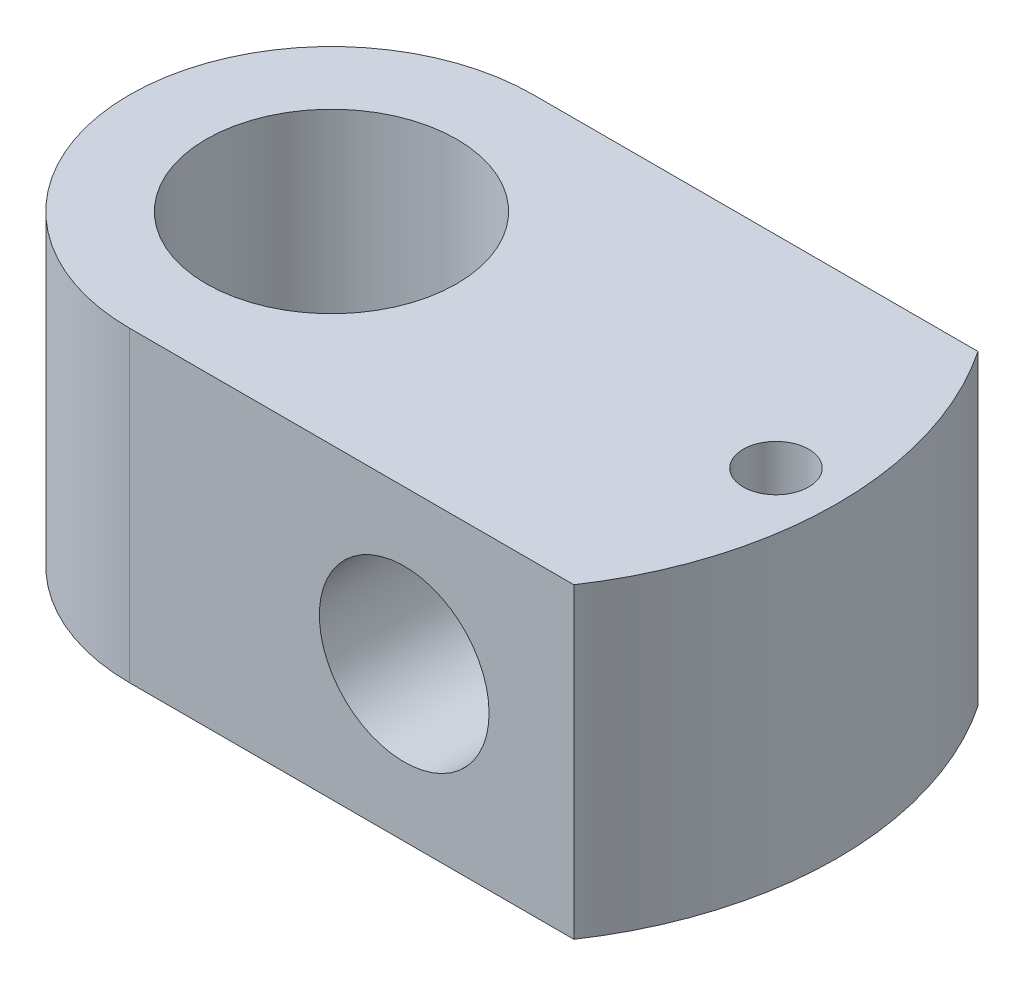
ISO-10303-21;
HEADER;
FILE_DESCRIPTION(('STEP AP214'),'2;1');
FILE_NAME('part.step','',(''),(''),'','','');
FILE_SCHEMA(('AUTOMOTIVE_DESIGN { 1 0 10303 214 1 1 1 1 }'));
ENDSEC;
DATA;
#1=APPLICATION_CONTEXT('core data for automotive mechanical design processes');
#2=APPLICATION_PROTOCOL_DEFINITION('international standard','automotive_design',2000,#1);
#3=PRODUCT_CONTEXT('',#1,'mechanical');
#4=PRODUCT('Part','Part','',(#3));
#5=PRODUCT_RELATED_PRODUCT_CATEGORY('part','',(#4));
#6=PRODUCT_DEFINITION_FORMATION('','',#4);
#7=PRODUCT_DEFINITION_CONTEXT('part definition',#1,'design');
#8=PRODUCT_DEFINITION('design','',#6,#7);
#9=PRODUCT_DEFINITION_SHAPE('','',#8);
#10=(LENGTH_UNIT() NAMED_UNIT(*) SI_UNIT(.MILLI.,.METRE.));
#11=(NAMED_UNIT(*) PLANE_ANGLE_UNIT() SI_UNIT($,.RADIAN.));
#12=(NAMED_UNIT(*) SI_UNIT($,.STERADIAN.) SOLID_ANGLE_UNIT());
#13=UNCERTAINTY_MEASURE_WITH_UNIT(LENGTH_MEASURE(1.E-05),#10,'distance_accuracy_value','');
#14=(GEOMETRIC_REPRESENTATION_CONTEXT(3) GLOBAL_UNCERTAINTY_ASSIGNED_CONTEXT((#13)) GLOBAL_UNIT_ASSIGNED_CONTEXT((#10,
#11,#12)) REPRESENTATION_CONTEXT('',''));
#15=CARTESIAN_POINT('',(0.,0.,0.));
#16=DIRECTION('',(0.,0.,1.));
#17=DIRECTION('',(1.,0.,0.));
#18=AXIS2_PLACEMENT_3D('',#15,#16,#17);
#19=CARTESIAN_POINT('',(0.,24.13,0.));
#20=DIRECTION('',(0.,-1.,0.));
#21=DIRECTION('',(0.,0.,-1.));
#22=AXIS2_PLACEMENT_3D('',#19,#20,#21);
#23=CYLINDRICAL_SURFACE('',#22,31.75);
#24=CARTESIAN_POINT('',(0.,-24.13,0.));
#25=DIRECTION('',(0.,1.,0.));
#26=DIRECTION('',(0.,0.,1.));
#27=AXIS2_PLACEMENT_3D('',#24,#25,#26);
#28=CIRCLE('',#27,31.75);
#29=CARTESIAN_POINT('',(0.,-24.13,-31.75));
#30=VERTEX_POINT('',#29);
#31=CARTESIAN_POINT('',(0.,-24.13,31.75));
#32=VERTEX_POINT('',#31);
#33=EDGE_CURVE('E95',#30,#32,#28,.T.);
#34=ORIENTED_EDGE('',*,*,#33,.T.);
#35=DIRECTION('',(0.,-1.,0.));
#36=VECTOR('',#35,1.);
#37=CARTESIAN_POINT('',(0.,24.13,31.75));
#38=LINE('',#37,#36);
#39=CARTESIAN_POINT('',(0.,24.13,31.75));
#40=VERTEX_POINT('',#39);
#41=EDGE_CURVE('E11',#40,#32,#38,.T.);
#42=ORIENTED_EDGE('',*,*,#41,.F.);
#43=CARTESIAN_POINT('',(0.,24.13,0.));
#44=DIRECTION('',(0.,1.,0.));
#45=DIRECTION('',(0.,0.,1.));
#46=AXIS2_PLACEMENT_3D('',#43,#44,#45);
#47=CIRCLE('',#46,31.75);
#48=CARTESIAN_POINT('',(0.,24.13,-31.75));
#49=VERTEX_POINT('',#48);
#50=EDGE_CURVE('E83',#49,#40,#47,.T.);
#51=ORIENTED_EDGE('',*,*,#50,.F.);
#52=DIRECTION('',(0.,-1.,0.));
#53=VECTOR('',#52,1.);
#54=CARTESIAN_POINT('',(0.,24.13,-31.75));
#55=LINE('',#54,#53);
#56=EDGE_CURVE('E91',#49,#30,#55,.T.);
#57=ORIENTED_EDGE('',*,*,#56,.T.);
#58=EDGE_LOOP('',(#34,#42,#51,#57));
#59=FACE_BOUND('',#58,.T.);
#60=ADVANCED_FACE('F32',(#59),#23,.T.);
#61=CARTESIAN_POINT('',(0.,24.13,31.75));
#62=DIRECTION('',(0.,0.,-1.));
#63=DIRECTION('',(-1.,0.,0.));
#64=AXIS2_PLACEMENT_3D('',#61,#62,#63);
#65=PLANE('',#64);
#66=CARTESIAN_POINT('',(43.18,0.,31.75));
#67=DIRECTION('',(0.,0.,1.));
#68=DIRECTION('',(1.,0.,0.));
#69=AXIS2_PLACEMENT_3D('',#66,#67,#68);
#70=CIRCLE('',#69,13.335);
#71=CARTESIAN_POINT('',(56.515,0.,31.75));
#72=VERTEX_POINT('',#71);
#73=EDGE_CURVE('E115',#72,#72,#70,.T.);
#74=ORIENTED_EDGE('',*,*,#73,.F.);
#75=EDGE_LOOP('',(#74));
#76=FACE_BOUND('',#75,.T.);
#77=DIRECTION('',(1.,0.,0.));
#78=VECTOR('',#77,1.);
#79=CARTESIAN_POINT('',(0.,-24.13,31.75));
#80=LINE('',#79,#78);
#81=CARTESIAN_POINT('',(69.85,-24.13,31.75));
#82=VERTEX_POINT('',#81);
#83=EDGE_CURVE('E87',#32,#82,#80,.T.);
#84=ORIENTED_EDGE('',*,*,#83,.T.);
#85=DIRECTION('',(0.,-1.,0.));
#86=VECTOR('',#85,1.);
#87=CARTESIAN_POINT('',(69.85,24.13,31.75));
#88=LINE('',#87,#86);
#89=CARTESIAN_POINT('',(69.85,24.13,31.75));
#90=VERTEX_POINT('',#89);
#91=EDGE_CURVE('E40',#90,#82,#88,.T.);
#92=ORIENTED_EDGE('',*,*,#91,.F.);
#93=DIRECTION('',(1.,0.,0.));
#94=VECTOR('',#93,1.);
#95=CARTESIAN_POINT('',(0.,24.13,31.75));
#96=LINE('',#95,#94);
#97=EDGE_CURVE('E78',#40,#90,#96,.T.);
#98=ORIENTED_EDGE('',*,*,#97,.F.);
#99=ORIENTED_EDGE('',*,*,#41,.T.);
#100=EDGE_LOOP('',(#84,#92,#98,#99));
#101=FACE_BOUND('',#100,.T.);
#102=ADVANCED_FACE('F86',(#76,#101),#65,.F.);
#103=CARTESIAN_POINT('',(22.4556052631578,24.13,0.));
#104=DIRECTION('',(0.,-1.,0.));
#105=DIRECTION('',(0.,0.,-1.));
#106=AXIS2_PLACEMENT_3D('',#103,#104,#105);
#107=CYLINDRICAL_SURFACE('',#106,57.0463947368421);
#108=CARTESIAN_POINT('',(22.4556052631578,-24.13,0.));
#109=DIRECTION('',(0.,1.,0.));
#110=DIRECTION('',(0.,0.,-1.));
#111=AXIS2_PLACEMENT_3D('',#108,#109,#110);
#112=CIRCLE('',#111,57.0463947368421);
#113=CARTESIAN_POINT('',(69.85,-24.13,-31.75));
#114=VERTEX_POINT('',#113);
#115=EDGE_CURVE('E65',#82,#114,#112,.T.);
#116=ORIENTED_EDGE('',*,*,#115,.T.);
#117=DIRECTION('',(0.,-1.,0.));
#118=VECTOR('',#117,1.);
#119=CARTESIAN_POINT('',(69.85,24.13,-31.75));
#120=LINE('',#119,#118);
#121=CARTESIAN_POINT('',(69.85,24.13,-31.75));
#122=VERTEX_POINT('',#121);
#123=EDGE_CURVE('E88',#122,#114,#120,.T.);
#124=ORIENTED_EDGE('',*,*,#123,.F.);
#125=CARTESIAN_POINT('',(22.4556052631578,24.13,0.));
#126=DIRECTION('',(0.,1.,0.));
#127=DIRECTION('',(0.,0.,-1.));
#128=AXIS2_PLACEMENT_3D('',#125,#126,#127);
#129=CIRCLE('',#128,57.0463947368421);
#130=EDGE_CURVE('E81',#90,#122,#129,.T.);
#131=ORIENTED_EDGE('',*,*,#130,.F.);
#132=ORIENTED_EDGE('',*,*,#91,.T.);
#133=EDGE_LOOP('',(#116,#124,#131,#132));
#134=FACE_BOUND('',#133,.T.);
#135=ADVANCED_FACE('F89',(#134),#107,.T.);
#136=CARTESIAN_POINT('',(0.,24.13,-31.75));
#137=DIRECTION('',(0.,0.,1.));
#138=DIRECTION('',(1.,0.,0.));
#139=AXIS2_PLACEMENT_3D('',#136,#137,#138);
#140=PLANE('',#139);
#141=CARTESIAN_POINT('',(43.18,0.,-31.75));
#142=DIRECTION('',(0.,0.,1.));
#143=DIRECTION('',(1.,0.,0.));
#144=AXIS2_PLACEMENT_3D('',#141,#142,#143);
#145=CIRCLE('',#144,13.335);
#146=CARTESIAN_POINT('',(56.515,0.,-31.75));
#147=VERTEX_POINT('',#146);
#148=EDGE_CURVE('E112',#147,#147,#145,.T.);
#149=ORIENTED_EDGE('',*,*,#148,.T.);
#150=EDGE_LOOP('',(#149));
#151=FACE_BOUND('',#150,.T.);
#152=DIRECTION('',(-1.,0.,0.));
#153=VECTOR('',#152,1.);
#154=CARTESIAN_POINT('',(0.,-24.13,-31.75));
#155=LINE('',#154,#153);
#156=EDGE_CURVE('E71',#114,#30,#155,.T.);
#157=ORIENTED_EDGE('',*,*,#156,.T.);
#158=ORIENTED_EDGE('',*,*,#56,.F.);
#159=DIRECTION('',(-1.,0.,0.));
#160=VECTOR('',#159,1.);
#161=CARTESIAN_POINT('',(0.,24.13,-31.75));
#162=LINE('',#161,#160);
#163=EDGE_CURVE('E48',#122,#49,#162,.T.);
#164=ORIENTED_EDGE('',*,*,#163,.F.);
#165=ORIENTED_EDGE('',*,*,#123,.T.);
#166=EDGE_LOOP('',(#157,#158,#164,#165));
#167=FACE_BOUND('',#166,.T.);
#168=ADVANCED_FACE('F103',(#151,#167),#140,.F.);
#169=CARTESIAN_POINT('',(0.,24.13,0.));
#170=DIRECTION('',(0.,1.,0.));
#171=DIRECTION('',(0.,0.,1.));
#172=AXIS2_PLACEMENT_3D('',#169,#170,#171);
#173=PLANE('',#172);
#174=CARTESIAN_POINT('',(69.85,24.13,0.));
#175=DIRECTION('',(0.,1.,0.));
#176=DIRECTION('',(0.,0.,1.));
#177=AXIS2_PLACEMENT_3D('',#174,#175,#176);
#178=CIRCLE('',#177,5.1435);
#179=CARTESIAN_POINT('',(69.85,24.13,5.1435));
#180=VERTEX_POINT('',#179);
#181=EDGE_CURVE('E121',#180,#180,#178,.T.);
#182=ORIENTED_EDGE('',*,*,#181,.F.);
#183=EDGE_LOOP('',(#182));
#184=FACE_BOUND('',#183,.T.);
#185=CARTESIAN_POINT('',(0.,24.13,0.));
#186=DIRECTION('',(0.,1.,0.));
#187=DIRECTION('',(0.,0.,1.));
#188=AXIS2_PLACEMENT_3D('',#185,#186,#187);
#189=CIRCLE('',#188,19.685);
#190=CARTESIAN_POINT('',(0.,24.13,19.685));
#191=VERTEX_POINT('',#190);
#192=EDGE_CURVE('E109',#191,#191,#189,.T.);
#193=ORIENTED_EDGE('',*,*,#192,.F.);
#194=EDGE_LOOP('',(#193));
#195=FACE_BOUND('',#194,.T.);
#196=ORIENTED_EDGE('',*,*,#50,.T.);
#197=ORIENTED_EDGE('',*,*,#97,.T.);
#198=ORIENTED_EDGE('',*,*,#130,.T.);
#199=ORIENTED_EDGE('',*,*,#163,.T.);
#200=EDGE_LOOP('',(#196,#197,#198,#199));
#201=FACE_BOUND('',#200,.T.);
#202=ADVANCED_FACE('F79',(#184,#195,#201),#173,.T.);
#203=CARTESIAN_POINT('',(0.,-24.13,0.));
#204=DIRECTION('',(0.,1.,0.));
#205=DIRECTION('',(0.,0.,1.));
#206=AXIS2_PLACEMENT_3D('',#203,#204,#205);
#207=PLANE('',#206);
#208=CARTESIAN_POINT('',(69.85,-24.13,0.));
#209=DIRECTION('',(0.,1.,0.));
#210=DIRECTION('',(0.,0.,1.));
#211=AXIS2_PLACEMENT_3D('',#208,#209,#210);
#212=CIRCLE('',#211,5.1435);
#213=CARTESIAN_POINT('',(69.85,-24.13,5.1435));
#214=VERTEX_POINT('',#213);
#215=EDGE_CURVE('E118',#214,#214,#212,.T.);
#216=ORIENTED_EDGE('',*,*,#215,.T.);
#217=EDGE_LOOP('',(#216));
#218=FACE_BOUND('',#217,.T.);
#219=CARTESIAN_POINT('',(0.,-24.13,0.));
#220=DIRECTION('',(0.,1.,0.));
#221=DIRECTION('',(0.,0.,1.));
#222=AXIS2_PLACEMENT_3D('',#219,#220,#221);
#223=CIRCLE('',#222,19.685);
#224=CARTESIAN_POINT('',(0.,-24.13,19.685));
#225=VERTEX_POINT('',#224);
#226=EDGE_CURVE('E98',#225,#225,#223,.T.);
#227=ORIENTED_EDGE('',*,*,#226,.T.);
#228=EDGE_LOOP('',(#227));
#229=FACE_BOUND('',#228,.T.);
#230=ORIENTED_EDGE('',*,*,#33,.F.);
#231=ORIENTED_EDGE('',*,*,#156,.F.);
#232=ORIENTED_EDGE('',*,*,#115,.F.);
#233=ORIENTED_EDGE('',*,*,#83,.F.);
#234=EDGE_LOOP('',(#230,#231,#232,#233));
#235=FACE_BOUND('',#234,.T.);
#236=ADVANCED_FACE('F106',(#218,#229,#235),#207,.F.);
#237=CARTESIAN_POINT('',(0.,-24.13,0.));
#238=DIRECTION('',(0.,1.,0.));
#239=DIRECTION('',(0.,0.,1.));
#240=AXIS2_PLACEMENT_3D('',#237,#238,#239);
#241=CYLINDRICAL_SURFACE('',#240,19.685);
#242=ORIENTED_EDGE('',*,*,#226,.F.);
#243=EDGE_LOOP('',(#242));
#244=FACE_BOUND('',#243,.T.);
#245=ORIENTED_EDGE('',*,*,#192,.T.);
#246=EDGE_LOOP('',(#245));
#247=FACE_BOUND('',#246,.T.);
#248=ADVANCED_FACE('F141',(#244,#247),#241,.F.);
#249=CARTESIAN_POINT('',(43.18,0.,-31.75));
#250=DIRECTION('',(0.,0.,1.));
#251=DIRECTION('',(1.,0.,0.));
#252=AXIS2_PLACEMENT_3D('',#249,#250,#251);
#253=CYLINDRICAL_SURFACE('',#252,13.335);
#254=ORIENTED_EDGE('',*,*,#148,.F.);
#255=EDGE_LOOP('',(#254));
#256=FACE_BOUND('',#255,.T.);
#257=ORIENTED_EDGE('',*,*,#73,.T.);
#258=EDGE_LOOP('',(#257));
#259=FACE_BOUND('',#258,.T.);
#260=ADVANCED_FACE('F132',(#256,#259),#253,.F.);
#261=CARTESIAN_POINT('',(69.85,-24.13,0.));
#262=DIRECTION('',(0.,1.,0.));
#263=DIRECTION('',(0.,0.,1.));
#264=AXIS2_PLACEMENT_3D('',#261,#262,#263);
#265=CYLINDRICAL_SURFACE('',#264,5.1435);
#266=ORIENTED_EDGE('',*,*,#215,.F.);
#267=EDGE_LOOP('',(#266));
#268=FACE_BOUND('',#267,.T.);
#269=ORIENTED_EDGE('',*,*,#181,.T.);
#270=EDGE_LOOP('',(#269));
#271=FACE_BOUND('',#270,.T.);
#272=ADVANCED_FACE('F129',(#268,#271),#265,.F.);
#273=CLOSED_SHELL('',(#60,#102,#135,#168,#202,#236,#248,#260,#272));
#274=MANIFOLD_SOLID_BREP('B2',#273);
#275=ADVANCED_BREP_SHAPE_REPRESENTATION('',(#18,#274),#14);
#276=SHAPE_DEFINITION_REPRESENTATION(#9,#275);
ENDSEC;
END-ISO-10303-21;
